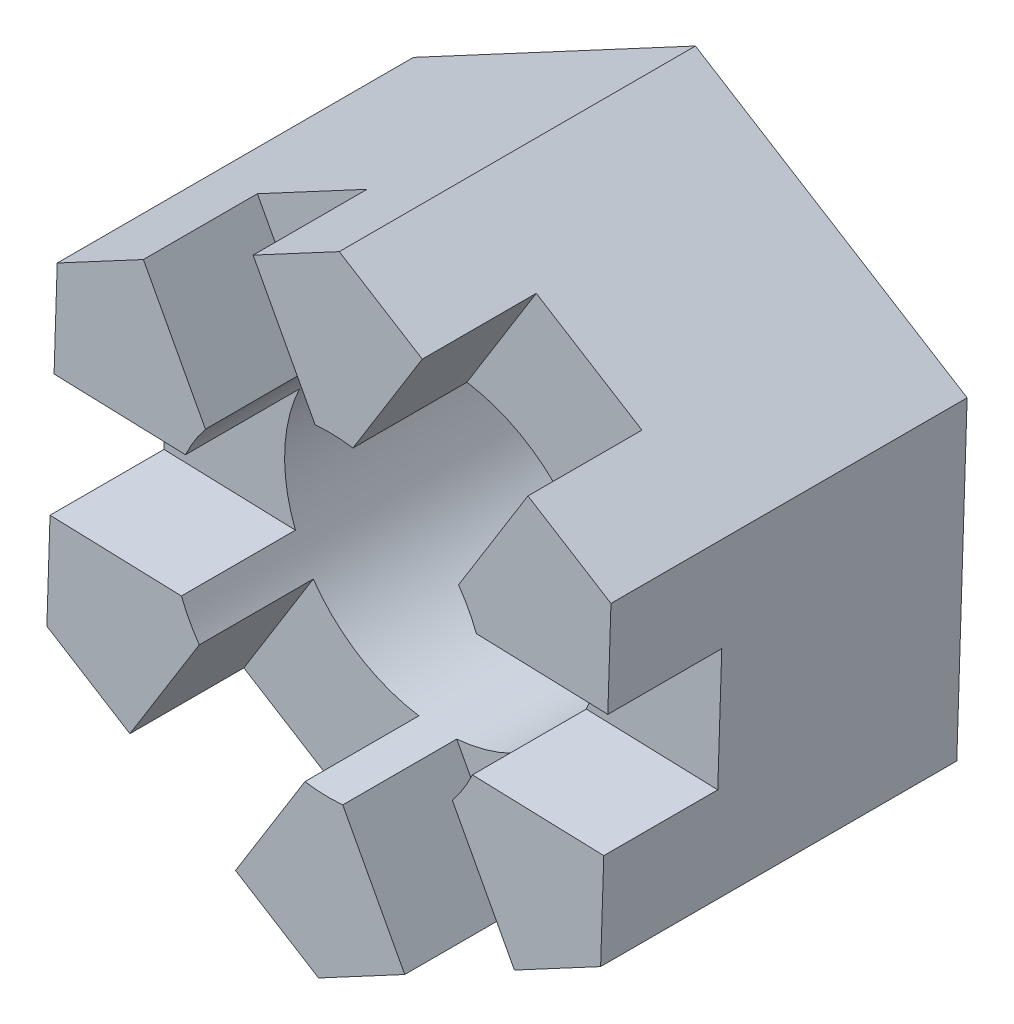
ISO-10303-21;
HEADER;
FILE_DESCRIPTION(('STEP AP214'),'2;1');
FILE_NAME('part.step','',(''),(''),'','','');
FILE_SCHEMA(('AUTOMOTIVE_DESIGN { 1 0 10303 214 1 1 1 1 }'));
ENDSEC;
DATA;
#1=APPLICATION_CONTEXT('core data for automotive mechanical design processes');
#2=APPLICATION_PROTOCOL_DEFINITION('international standard','automotive_design',2000,#1);
#3=PRODUCT_CONTEXT('',#1,'mechanical');
#4=PRODUCT('Part','Part','',(#3));
#5=PRODUCT_RELATED_PRODUCT_CATEGORY('part','',(#4));
#6=PRODUCT_DEFINITION_FORMATION('','',#4);
#7=PRODUCT_DEFINITION_CONTEXT('part definition',#1,'design');
#8=PRODUCT_DEFINITION('design','',#6,#7);
#9=PRODUCT_DEFINITION_SHAPE('','',#8);
#10=(LENGTH_UNIT() NAMED_UNIT(*) SI_UNIT(.MILLI.,.METRE.));
#11=(NAMED_UNIT(*) PLANE_ANGLE_UNIT() SI_UNIT($,.RADIAN.));
#12=(NAMED_UNIT(*) SI_UNIT($,.STERADIAN.) SOLID_ANGLE_UNIT());
#13=UNCERTAINTY_MEASURE_WITH_UNIT(LENGTH_MEASURE(1.E-05),#10,'distance_accuracy_value','');
#14=(GEOMETRIC_REPRESENTATION_CONTEXT(3) GLOBAL_UNCERTAINTY_ASSIGNED_CONTEXT((#13)) GLOBAL_UNIT_ASSIGNED_CONTEXT((#10,
#11,#12)) REPRESENTATION_CONTEXT('',''));
#15=CARTESIAN_POINT('',(0.,0.,0.));
#16=DIRECTION('',(0.,0.,1.));
#17=DIRECTION('',(1.,0.,0.));
#18=AXIS2_PLACEMENT_3D('',#15,#16,#17);
#19=CARTESIAN_POINT('',(5.65719187726186,3.0263397276538,7.14375));
#20=DIRECTION('',(0.,0.,1.));
#21=DIRECTION('',(1.,0.,0.));
#22=AXIS2_PLACEMENT_3D('',#19,#20,#21);
#23=PLANE('',#22);
#24=DIRECTION('',(-0.471700712644366,0.881758718522702,0.));
#25=VECTOR('',#24,1.);
#26=CARTESIAN_POINT('',(-1.89543674075156,6.18754430662847,7.14375));
#27=LINE('',#26,#25);
#28=CARTESIAN_POINT('',(-0.277369211780051,3.16286125531243,7.14375));
#29=VERTEX_POINT('',#28);
#30=CARTESIAN_POINT('',(-1.5210243000901,5.48764832380109,7.14375));
#31=VERTEX_POINT('',#30);
#32=EDGE_CURVE('E260',#29,#31,#27,.T.);
#33=ORIENTED_EDGE('',*,*,#32,.F.);
#34=CARTESIAN_POINT('',(0.,0.,7.14375));
#35=DIRECTION('',(0.,0.,1.));
#36=DIRECTION('',(1.,0.,0.));
#37=AXIS2_PLACEMENT_3D('',#34,#35,#36);
#38=CIRCLE('',#37,3.175);
#39=CARTESIAN_POINT('',(0.48147291031505,3.13828119145381,7.14375));
#40=VERTEX_POINT('',#39);
#41=EDGE_CURVE('E321',#40,#29,#38,.T.);
#42=ORIENTED_EDGE('',*,*,#41,.F.);
#43=DIRECTION('',(-0.527775093926886,-0.849384159394598,0.));
#44=VECTOR('',#43,1.);
#45=CARTESIAN_POINT('',(-4.41085218620622,-4.73526852207148,7.14375));
#46=LINE('',#45,#44);
#47=CARTESIAN_POINT('',(1.87297002586075,5.37771162572043,7.14375));
#48=VERTEX_POINT('',#47);
#49=EDGE_CURVE('E289',#48,#40,#46,.T.);
#50=ORIENTED_EDGE('',*,*,#49,.F.);
#51=DIRECTION('',(-0.849384159394597,0.527775093926886,0.));
#52=VECTOR('',#51,1.);
#53=CARTESIAN_POINT('',(5.65719187726186,3.0263397276538,7.14375));
#54=LINE('',#53,#52);
#55=CARTESIAN_POINT('',(0.207708854000658,6.41244174361865,7.14375));
#56=VERTEX_POINT('',#55);
#57=EDGE_CURVE('E327',#48,#56,#54,.T.);
#58=ORIENTED_EDGE('',*,*,#57,.T.);
#59=DIRECTION('',(-0.8817587185227,-0.471700712644369,0.));
#60=VECTOR('',#59,1.);
#61=CARTESIAN_POINT('',(0.207708854000658,6.41244174361865,7.14375));
#62=LINE('',#61,#60);
#63=EDGE_CURVE('E332',#56,#31,#62,.T.);
#64=ORIENTED_EDGE('',*,*,#63,.T.);
#65=EDGE_LOOP('',(#33,#42,#50,#58,#64));
#66=FACE_BOUND('',#65,.T.);
#67=ADVANCED_FACE('F32',(#66),#23,.T.);
#68=DIRECTION('',(0.471700712644366,-0.881758718522702,0.));
#69=VECTOR('',#68,1.);
#70=CARTESIAN_POINT('',(-4.09516230983187,5.01079141860982,7.14375));
#71=LINE('',#70,#69);
#72=CARTESIAN_POINT('',(-3.72074986917041,4.31089543578243,7.14375));
#73=VERTEX_POINT('',#72);
#74=CARTESIAN_POINT('',(-2.47709478086036,1.98610836729378,7.14375));
#75=VERTEX_POINT('',#74);
#76=EDGE_CURVE('E445',#73,#75,#71,.T.);
#77=ORIENTED_EDGE('',*,*,#76,.F.);
#78=CARTESIAN_POINT('',(-5.44948302326121,3.38610201596485,7.14375));
#79=VERTEX_POINT('',#78);
#80=EDGE_CURVE('E331',#73,#79,#62,.T.);
#81=ORIENTED_EDGE('',*,*,#80,.T.);
#82=DIRECTION('',(-0.0323745591281028,-0.999475806571255,0.));
#83=VECTOR('',#82,1.);
#84=CARTESIAN_POINT('',(-5.44948302326121,3.38610201596485,7.14375));
#85=LINE('',#84,#83);
#86=CARTESIAN_POINT('',(-5.51295500549189,1.4265784782491,7.14375));
#87=VERTEX_POINT('',#86);
#88=EDGE_CURVE('E336',#79,#87,#85,.T.);
#89=ORIENTED_EDGE('',*,*,#88,.T.);
#90=DIRECTION('',(-0.999475806571255,0.0323745591281116,0.));
#91=VECTOR('',#90,1.);
#92=CARTESIAN_POINT('',(6.38705381649711,1.04111888363002,7.14375));
#93=LINE('',#92,#91);
#94=CARTESIAN_POINT('',(-2.87780280163612,1.34122184402704,7.14375));
#95=VERTEX_POINT('',#94);
#96=EDGE_CURVE('E441',#95,#87,#93,.T.);
#97=ORIENTED_EDGE('',*,*,#96,.F.);
#98=EDGE_CURVE('E470',#75,#95,#38,.T.);
#99=ORIENTED_EDGE('',*,*,#98,.F.);
#100=EDGE_LOOP('',(#77,#81,#89,#97,#99));
#101=FACE_BOUND('',#100,.T.);
#102=ADVANCED_FACE('F495',(#101),#23,.T.);
#103=CARTESIAN_POINT('',(3.72074986917041,-4.31089543578243,7.14375));
#104=VERTEX_POINT('',#103);
#105=CARTESIAN_POINT('',(2.47709478086036,-1.98610836729378,7.14375));
#106=VERTEX_POINT('',#105);
#107=EDGE_CURVE('E449',#104,#106,#27,.T.);
#108=ORIENTED_EDGE('',*,*,#107,.F.);
#109=DIRECTION('',(0.8817587185227,0.471700712644369,0.));
#110=VECTOR('',#109,1.);
#111=CARTESIAN_POINT('',(-0.207708854000655,-6.41244174361866,7.14375));
#112=LINE('',#111,#110);
#113=CARTESIAN_POINT('',(5.44948302326121,-3.38610201596485,7.14375));
#114=VERTEX_POINT('',#113);
#115=EDGE_CURVE('E343',#104,#114,#112,.T.);
#116=ORIENTED_EDGE('',*,*,#115,.T.);
#117=DIRECTION('',(0.0323745591281028,0.999475806571255,0.));
#118=VECTOR('',#117,1.);
#119=CARTESIAN_POINT('',(5.44948302326121,-3.38610201596485,7.14375));
#120=LINE('',#119,#118);
#121=CARTESIAN_POINT('',(5.51295500549189,-1.4265784782491,7.14375));
#122=VERTEX_POINT('',#121);
#123=EDGE_CURVE('E324',#114,#122,#120,.T.);
#124=ORIENTED_EDGE('',*,*,#123,.T.);
#125=DIRECTION('',(0.999475806571255,-0.0323745591281116,0.));
#126=VECTOR('',#125,1.);
#127=CARTESIAN_POINT('',(6.3062889269578,-1.45227578455704,7.14375));
#128=LINE('',#127,#126);
#129=CARTESIAN_POINT('',(2.87780280163612,-1.34122184402704,7.14375));
#130=VERTEX_POINT('',#129);
#131=EDGE_CURVE('E436',#130,#122,#128,.T.);
#132=ORIENTED_EDGE('',*,*,#131,.F.);
#133=EDGE_CURVE('E319',#106,#130,#38,.T.);
#134=ORIENTED_EDGE('',*,*,#133,.F.);
#135=EDGE_LOOP('',(#108,#116,#124,#132,#134));
#136=FACE_BOUND('',#135,.T.);
#137=ADVANCED_FACE('F466',(#136),#23,.T.);
#138=CARTESIAN_POINT('',(0.27736921178005,-3.16286125531243,7.14375));
#139=VERTEX_POINT('',#138);
#140=CARTESIAN_POINT('',(1.5210243000901,-5.48764832380109,7.14375));
#141=VERTEX_POINT('',#140);
#142=EDGE_CURVE('E440',#139,#141,#71,.T.);
#143=ORIENTED_EDGE('',*,*,#142,.F.);
#144=CARTESIAN_POINT('',(-0.48147291031505,-3.13828119145381,7.14375));
#145=VERTEX_POINT('',#144);
#146=EDGE_CURVE('E315',#145,#139,#38,.T.);
#147=ORIENTED_EDGE('',*,*,#146,.F.);
#148=DIRECTION('',(0.527775093926886,0.849384159394598,0.));
#149=VECTOR('',#148,1.);
#150=CARTESIAN_POINT('',(-2.29189150666521,-6.05191030223988,7.14375));
#151=LINE('',#150,#149);
#152=CARTESIAN_POINT('',(-1.87297002586075,-5.37771162572043,7.14375));
#153=VERTEX_POINT('',#152);
#154=EDGE_CURVE('E295',#153,#145,#151,.T.);
#155=ORIENTED_EDGE('',*,*,#154,.F.);
#156=DIRECTION('',(0.849384159394597,-0.527775093926886,0.));
#157=VECTOR('',#156,1.);
#158=CARTESIAN_POINT('',(-5.65719187726186,-3.0263397276538,7.14375));
#159=LINE('',#158,#157);
#160=CARTESIAN_POINT('',(-0.207708854000655,-6.41244174361866,7.14375));
#161=VERTEX_POINT('',#160);
#162=EDGE_CURVE('E339',#153,#161,#159,.T.);
#163=ORIENTED_EDGE('',*,*,#162,.T.);
#164=EDGE_CURVE('E344',#161,#141,#112,.T.);
#165=ORIENTED_EDGE('',*,*,#164,.T.);
#166=EDGE_LOOP('',(#143,#147,#155,#163,#165));
#167=FACE_BOUND('',#166,.T.);
#168=ADVANCED_FACE('F525',(#167),#23,.T.);
#169=CARTESIAN_POINT('',(-5.59371989503118,-1.06681618993796,7.14375));
#170=VERTEX_POINT('',#169);
#171=CARTESIAN_POINT('',(-2.95856769117543,-1.15217282416002,7.14375));
#172=VERTEX_POINT('',#171);
#173=EDGE_CURVE('E435',#170,#172,#128,.T.);
#174=ORIENTED_EDGE('',*,*,#173,.F.);
#175=CARTESIAN_POINT('',(-5.65719187726186,-3.0263397276538,7.14375));
#176=VERTEX_POINT('',#175);
#177=EDGE_CURVE('E335',#170,#176,#85,.T.);
#178=ORIENTED_EDGE('',*,*,#177,.T.);
#179=CARTESIAN_POINT('',(-3.99193070540177,-4.06106984555203,7.14375));
#180=VERTEX_POINT('',#179);
#181=EDGE_CURVE('E340',#176,#180,#159,.T.);
#182=ORIENTED_EDGE('',*,*,#181,.T.);
#183=CARTESIAN_POINT('',(-2.60043358985607,-1.82163941128542,7.14375));
#184=VERTEX_POINT('',#183);
#185=EDGE_CURVE('E296',#184,#180,#46,.T.);
#186=ORIENTED_EDGE('',*,*,#185,.F.);
#187=EDGE_CURVE('E318',#172,#184,#38,.T.);
#188=ORIENTED_EDGE('',*,*,#187,.F.);
#189=EDGE_LOOP('',(#174,#178,#182,#186,#188));
#190=FACE_BOUND('',#189,.T.);
#191=ADVANCED_FACE('F503',(#190),#23,.T.);
#192=CARTESIAN_POINT('',(5.59371989503118,1.06681618993796,7.14375));
#193=VERTEX_POINT('',#192);
#194=CARTESIAN_POINT('',(2.95856769117543,1.15217282416002,7.14375));
#195=VERTEX_POINT('',#194);
#196=EDGE_CURVE('E442',#193,#195,#93,.T.);
#197=ORIENTED_EDGE('',*,*,#196,.F.);
#198=CARTESIAN_POINT('',(5.65719187726186,3.0263397276538,7.14375));
#199=VERTEX_POINT('',#198);
#200=EDGE_CURVE('E252',#193,#199,#120,.T.);
#201=ORIENTED_EDGE('',*,*,#200,.T.);
#202=CARTESIAN_POINT('',(3.99193070540177,4.06106984555203,7.14375));
#203=VERTEX_POINT('',#202);
#204=EDGE_CURVE('E328',#199,#203,#54,.T.);
#205=ORIENTED_EDGE('',*,*,#204,.T.);
#206=CARTESIAN_POINT('',(2.60043358985607,1.82163941128542,7.14375));
#207=VERTEX_POINT('',#206);
#208=EDGE_CURVE('E284',#207,#203,#151,.T.);
#209=ORIENTED_EDGE('',*,*,#208,.F.);
#210=EDGE_CURVE('E320',#195,#207,#38,.T.);
#211=ORIENTED_EDGE('',*,*,#210,.F.);
#212=EDGE_LOOP('',(#197,#201,#205,#209,#211));
#213=FACE_BOUND('',#212,.T.);
#214=ADVANCED_FACE('F541',(#213),#23,.T.);
#215=CARTESIAN_POINT('',(5.65719187726186,3.0263397276538,0.));
#216=DIRECTION('',(0.,0.,1.));
#217=DIRECTION('',(1.,0.,0.));
#218=AXIS2_PLACEMENT_3D('',#215,#216,#217);
#219=PLANE('',#218);
#220=DIRECTION('',(0.0323745591281028,0.999475806571255,0.));
#221=VECTOR('',#220,1.);
#222=CARTESIAN_POINT('',(5.44948302326121,-3.38610201596485,0.));
#223=LINE('',#222,#221);
#224=CARTESIAN_POINT('',(5.44948302326121,-3.38610201596485,0.));
#225=VERTEX_POINT('',#224);
#226=CARTESIAN_POINT('',(5.65719187726186,3.0263397276538,0.));
#227=VERTEX_POINT('',#226);
#228=EDGE_CURVE('E348',#225,#227,#223,.T.);
#229=ORIENTED_EDGE('',*,*,#228,.F.);
#230=DIRECTION('',(0.8817587185227,0.471700712644369,0.));
#231=VECTOR('',#230,1.);
#232=CARTESIAN_POINT('',(-0.207708854000655,-6.41244174361866,0.));
#233=LINE('',#232,#231);
#234=CARTESIAN_POINT('',(-0.207708854000655,-6.41244174361866,0.));
#235=VERTEX_POINT('',#234);
#236=EDGE_CURVE('E359',#235,#225,#233,.T.);
#237=ORIENTED_EDGE('',*,*,#236,.F.);
#238=DIRECTION('',(0.849384159394597,-0.527775093926886,0.));
#239=VECTOR('',#238,1.);
#240=CARTESIAN_POINT('',(-5.65719187726186,-3.0263397276538,0.));
#241=LINE('',#240,#239);
#242=CARTESIAN_POINT('',(-5.65719187726186,-3.0263397276538,0.));
#243=VERTEX_POINT('',#242);
#244=EDGE_CURVE('E357',#243,#235,#241,.T.);
#245=ORIENTED_EDGE('',*,*,#244,.F.);
#246=DIRECTION('',(-0.0323745591281028,-0.999475806571255,0.));
#247=VECTOR('',#246,1.);
#248=CARTESIAN_POINT('',(-5.44948302326121,3.38610201596485,0.));
#249=LINE('',#248,#247);
#250=CARTESIAN_POINT('',(-5.44948302326121,3.38610201596485,0.));
#251=VERTEX_POINT('',#250);
#252=EDGE_CURVE('E355',#251,#243,#249,.T.);
#253=ORIENTED_EDGE('',*,*,#252,.F.);
#254=DIRECTION('',(-0.8817587185227,-0.471700712644369,0.));
#255=VECTOR('',#254,1.);
#256=CARTESIAN_POINT('',(0.207708854000658,6.41244174361865,0.));
#257=LINE('',#256,#255);
#258=CARTESIAN_POINT('',(0.207708854000658,6.41244174361865,0.));
#259=VERTEX_POINT('',#258);
#260=EDGE_CURVE('E353',#259,#251,#257,.T.);
#261=ORIENTED_EDGE('',*,*,#260,.F.);
#262=DIRECTION('',(-0.849384159394597,0.527775093926886,0.));
#263=VECTOR('',#262,1.);
#264=CARTESIAN_POINT('',(5.65719187726186,3.0263397276538,0.));
#265=LINE('',#264,#263);
#266=EDGE_CURVE('E351',#227,#259,#265,.T.);
#267=ORIENTED_EDGE('',*,*,#266,.F.);
#268=EDGE_LOOP('',(#229,#237,#245,#253,#261,#267));
#269=FACE_BOUND('',#268,.T.);
#270=CARTESIAN_POINT('',(0.,0.,0.));
#271=DIRECTION('',(0.,0.,1.));
#272=DIRECTION('',(1.,0.,0.));
#273=AXIS2_PLACEMENT_3D('',#270,#271,#272);
#274=CIRCLE('',#273,3.175);
#275=CARTESIAN_POINT('',(3.175,0.,0.));
#276=VERTEX_POINT('',#275);
#277=EDGE_CURVE('E314',#276,#276,#274,.T.);
#278=ORIENTED_EDGE('',*,*,#277,.T.);
#279=EDGE_LOOP('',(#278));
#280=FACE_BOUND('',#279,.T.);
#281=ADVANCED_FACE('F548',(#269,#280),#219,.F.);
#282=CARTESIAN_POINT('',(5.44948302326121,-3.38610201596485,7.14375));
#283=DIRECTION('',(-0.999475806571255,0.0323745591281028,0.));
#284=DIRECTION('',(-0.0323745591281028,-0.999475806571255,0.));
#285=AXIS2_PLACEMENT_3D('',#282,#283,#284);
#286=PLANE('',#285);
#287=DIRECTION('',(0.0323745591281028,0.999475806571255,0.));
#288=VECTOR('',#287,1.);
#289=CARTESIAN_POINT('',(5.44948302326121,-3.38610201596485,4.85775));
#290=LINE('',#289,#288);
#291=CARTESIAN_POINT('',(5.51295500549189,-1.4265784782491,4.85775));
#292=VERTEX_POINT('',#291);
#293=CARTESIAN_POINT('',(5.59371989503118,1.06681618993796,4.85775));
#294=VERTEX_POINT('',#293);
#295=EDGE_CURVE('E229',#292,#294,#290,.T.);
#296=ORIENTED_EDGE('',*,*,#295,.F.);
#297=DIRECTION('',(0.,0.,1.));
#298=VECTOR('',#297,1.);
#299=CARTESIAN_POINT('',(5.51295500549189,-1.4265784782491,7.14375));
#300=LINE('',#299,#298);
#301=EDGE_CURVE('E253',#292,#122,#300,.T.);
#302=ORIENTED_EDGE('',*,*,#301,.T.);
#303=ORIENTED_EDGE('',*,*,#123,.F.);
#304=DIRECTION('',(0.,0.,-1.));
#305=VECTOR('',#304,1.);
#306=CARTESIAN_POINT('',(5.44948302326121,-3.38610201596485,7.14375));
#307=LINE('',#306,#305);
#308=EDGE_CURVE('E347',#114,#225,#307,.T.);
#309=ORIENTED_EDGE('',*,*,#308,.T.);
#310=ORIENTED_EDGE('',*,*,#228,.T.);
#311=DIRECTION('',(0.,0.,-1.));
#312=VECTOR('',#311,1.);
#313=CARTESIAN_POINT('',(5.65719187726186,3.0263397276538,7.14375));
#314=LINE('',#313,#312);
#315=EDGE_CURVE('E375',#199,#227,#314,.T.);
#316=ORIENTED_EDGE('',*,*,#315,.F.);
#317=ORIENTED_EDGE('',*,*,#200,.F.);
#318=DIRECTION('',(0.,0.,-1.));
#319=VECTOR('',#318,1.);
#320=CARTESIAN_POINT('',(5.59371989503118,1.06681618993796,7.14375));
#321=LINE('',#320,#319);
#322=EDGE_CURVE('E244',#193,#294,#321,.T.);
#323=ORIENTED_EDGE('',*,*,#322,.T.);
#324=EDGE_LOOP('',(#296,#302,#303,#309,#310,#316,#317,#323));
#325=FACE_BOUND('',#324,.T.);
#326=ADVANCED_FACE('F34',(#325),#286,.F.);
#327=CARTESIAN_POINT('',(5.65719187726186,3.0263397276538,7.14375));
#328=DIRECTION('',(-0.527775093926886,-0.849384159394597,0.));
#329=DIRECTION('',(0.849384159394597,-0.527775093926886,0.));
#330=AXIS2_PLACEMENT_3D('',#327,#328,#329);
#331=PLANE('',#330);
#332=ORIENTED_EDGE('',*,*,#57,.F.);
#333=DIRECTION('',(0.,0.,-1.));
#334=VECTOR('',#333,1.);
#335=CARTESIAN_POINT('',(1.87297002586075,5.37771162572043,7.14375));
#336=LINE('',#335,#334);
#337=CARTESIAN_POINT('',(1.87297002586075,5.37771162572043,4.85775));
#338=VERTEX_POINT('',#337);
#339=EDGE_CURVE('E311',#48,#338,#336,.T.);
#340=ORIENTED_EDGE('',*,*,#339,.T.);
#341=DIRECTION('',(-0.849384159394597,0.527775093926886,0.));
#342=VECTOR('',#341,1.);
#343=CARTESIAN_POINT('',(5.65719187726186,3.0263397276538,4.85775));
#344=LINE('',#343,#342);
#345=CARTESIAN_POINT('',(3.99193070540177,4.06106984555203,4.85775));
#346=VERTEX_POINT('',#345);
#347=EDGE_CURVE('E300',#346,#338,#344,.T.);
#348=ORIENTED_EDGE('',*,*,#347,.F.);
#349=DIRECTION('',(0.,0.,1.));
#350=VECTOR('',#349,1.);
#351=CARTESIAN_POINT('',(3.99193070540176,4.06106984555203,7.14375));
#352=LINE('',#351,#350);
#353=EDGE_CURVE('E305',#346,#203,#352,.T.);
#354=ORIENTED_EDGE('',*,*,#353,.T.);
#355=ORIENTED_EDGE('',*,*,#204,.F.);
#356=ORIENTED_EDGE('',*,*,#315,.T.);
#357=ORIENTED_EDGE('',*,*,#266,.T.);
#358=DIRECTION('',(0.,0.,-1.));
#359=VECTOR('',#358,1.);
#360=CARTESIAN_POINT('',(0.207708854000658,6.41244174361865,7.14375));
#361=LINE('',#360,#359);
#362=EDGE_CURVE('E372',#56,#259,#361,.T.);
#363=ORIENTED_EDGE('',*,*,#362,.F.);
#364=EDGE_LOOP('',(#332,#340,#348,#354,#355,#356,#357,#363));
#365=FACE_BOUND('',#364,.T.);
#366=ADVANCED_FACE('F564',(#365),#331,.F.);
#367=CARTESIAN_POINT('',(0.207708854000658,6.41244174361865,7.14375));
#368=DIRECTION('',(0.471700712644369,-0.8817587185227,0.));
#369=DIRECTION('',(0.8817587185227,0.471700712644369,0.));
#370=AXIS2_PLACEMENT_3D('',#367,#368,#369);
#371=PLANE('',#370);
#372=DIRECTION('',(-0.8817587185227,-0.471700712644369,0.));
#373=VECTOR('',#372,1.);
#374=CARTESIAN_POINT('',(0.207708854000658,6.41244174361865,4.85775));
#375=LINE('',#374,#373);
#376=CARTESIAN_POINT('',(-1.5210243000901,5.48764832380109,4.85775));
#377=VERTEX_POINT('',#376);
#378=CARTESIAN_POINT('',(-3.72074986917041,4.31089543578243,4.85775));
#379=VERTEX_POINT('',#378);
#380=EDGE_CURVE('E240',#377,#379,#375,.T.);
#381=ORIENTED_EDGE('',*,*,#380,.F.);
#382=DIRECTION('',(0.,0.,1.));
#383=VECTOR('',#382,1.);
#384=CARTESIAN_POINT('',(-1.5210243000901,5.48764832380109,7.14375));
#385=LINE('',#384,#383);
#386=EDGE_CURVE('E275',#377,#31,#385,.T.);
#387=ORIENTED_EDGE('',*,*,#386,.T.);
#388=ORIENTED_EDGE('',*,*,#63,.F.);
#389=ORIENTED_EDGE('',*,*,#362,.T.);
#390=ORIENTED_EDGE('',*,*,#260,.T.);
#391=DIRECTION('',(0.,0.,-1.));
#392=VECTOR('',#391,1.);
#393=CARTESIAN_POINT('',(-5.44948302326121,3.38610201596485,7.14375));
#394=LINE('',#393,#392);
#395=EDGE_CURVE('E369',#79,#251,#394,.T.);
#396=ORIENTED_EDGE('',*,*,#395,.F.);
#397=ORIENTED_EDGE('',*,*,#80,.F.);
#398=DIRECTION('',(0.,0.,-1.));
#399=VECTOR('',#398,1.);
#400=CARTESIAN_POINT('',(-3.72074986917041,4.31089543578243,7.14375));
#401=LINE('',#400,#399);
#402=EDGE_CURVE('E239',#73,#379,#401,.T.);
#403=ORIENTED_EDGE('',*,*,#402,.T.);
#404=EDGE_LOOP('',(#381,#387,#388,#389,#390,#396,#397,#403));
#405=FACE_BOUND('',#404,.T.);
#406=ADVANCED_FACE('F484',(#405),#371,.F.);
#407=CARTESIAN_POINT('',(-5.44948302326121,3.38610201596485,7.14375));
#408=DIRECTION('',(0.999475806571255,-0.0323745591281028,0.));
#409=DIRECTION('',(0.0323745591281028,0.999475806571255,0.));
#410=AXIS2_PLACEMENT_3D('',#407,#408,#409);
#411=PLANE('',#410);
#412=DIRECTION('',(-0.0323745591281028,-0.999475806571255,0.));
#413=VECTOR('',#412,1.);
#414=CARTESIAN_POINT('',(-5.44948302326121,3.38610201596485,4.85775));
#415=LINE('',#414,#413);
#416=CARTESIAN_POINT('',(-5.51295500549189,1.4265784782491,4.85775));
#417=VERTEX_POINT('',#416);
#418=CARTESIAN_POINT('',(-5.59371989503118,-1.06681618993796,4.85775));
#419=VERTEX_POINT('',#418);
#420=EDGE_CURVE('E270',#417,#419,#415,.T.);
#421=ORIENTED_EDGE('',*,*,#420,.F.);
#422=DIRECTION('',(0.,0.,1.));
#423=VECTOR('',#422,1.);
#424=CARTESIAN_POINT('',(-5.51295500549189,1.4265784782491,7.14375));
#425=LINE('',#424,#423);
#426=EDGE_CURVE('E265',#417,#87,#425,.T.);
#427=ORIENTED_EDGE('',*,*,#426,.T.);
#428=ORIENTED_EDGE('',*,*,#88,.F.);
#429=ORIENTED_EDGE('',*,*,#395,.T.);
#430=ORIENTED_EDGE('',*,*,#252,.T.);
#431=DIRECTION('',(0.,0.,-1.));
#432=VECTOR('',#431,1.);
#433=CARTESIAN_POINT('',(-5.65719187726186,-3.0263397276538,7.14375));
#434=LINE('',#433,#432);
#435=EDGE_CURVE('E366',#176,#243,#434,.T.);
#436=ORIENTED_EDGE('',*,*,#435,.F.);
#437=ORIENTED_EDGE('',*,*,#177,.F.);
#438=DIRECTION('',(0.,0.,-1.));
#439=VECTOR('',#438,1.);
#440=CARTESIAN_POINT('',(-5.59371989503118,-1.06681618993796,7.14375));
#441=LINE('',#440,#439);
#442=EDGE_CURVE('E255',#170,#419,#441,.T.);
#443=ORIENTED_EDGE('',*,*,#442,.T.);
#444=EDGE_LOOP('',(#421,#427,#428,#429,#430,#436,#437,#443));
#445=FACE_BOUND('',#444,.T.);
#446=ADVANCED_FACE('F497',(#445),#411,.F.);
#447=CARTESIAN_POINT('',(-5.65719187726186,-3.0263397276538,7.14375));
#448=DIRECTION('',(0.527775093926886,0.849384159394597,0.));
#449=DIRECTION('',(-0.849384159394597,0.527775093926886,0.));
#450=AXIS2_PLACEMENT_3D('',#447,#448,#449);
#451=PLANE('',#450);
#452=DIRECTION('',(0.849384159394597,-0.527775093926886,0.));
#453=VECTOR('',#452,1.);
#454=CARTESIAN_POINT('',(-5.65719187726186,-3.0263397276538,4.85775));
#455=LINE('',#454,#453);
#456=CARTESIAN_POINT('',(-3.99193070540177,-4.06106984555203,4.85775));
#457=VERTEX_POINT('',#456);
#458=CARTESIAN_POINT('',(-1.87297002586075,-5.37771162572043,4.85775));
#459=VERTEX_POINT('',#458);
#460=EDGE_CURVE('E298',#457,#459,#455,.T.);
#461=ORIENTED_EDGE('',*,*,#460,.F.);
#462=DIRECTION('',(0.,0.,1.));
#463=VECTOR('',#462,1.);
#464=CARTESIAN_POINT('',(-3.99193070540177,-4.06106984555203,7.14375));
#465=LINE('',#464,#463);
#466=EDGE_CURVE('E308',#457,#180,#465,.T.);
#467=ORIENTED_EDGE('',*,*,#466,.T.);
#468=ORIENTED_EDGE('',*,*,#181,.F.);
#469=ORIENTED_EDGE('',*,*,#435,.T.);
#470=ORIENTED_EDGE('',*,*,#244,.T.);
#471=DIRECTION('',(0.,0.,-1.));
#472=VECTOR('',#471,1.);
#473=CARTESIAN_POINT('',(-0.207708854000655,-6.41244174361866,7.14375));
#474=LINE('',#473,#472);
#475=EDGE_CURVE('E363',#161,#235,#474,.T.);
#476=ORIENTED_EDGE('',*,*,#475,.F.);
#477=ORIENTED_EDGE('',*,*,#162,.F.);
#478=DIRECTION('',(0.,0.,-1.));
#479=VECTOR('',#478,1.);
#480=CARTESIAN_POINT('',(-1.87297002586075,-5.37771162572043,7.14375));
#481=LINE('',#480,#479);
#482=EDGE_CURVE('E302',#153,#459,#481,.T.);
#483=ORIENTED_EDGE('',*,*,#482,.T.);
#484=EDGE_LOOP('',(#461,#467,#468,#469,#470,#476,#477,#483));
#485=FACE_BOUND('',#484,.T.);
#486=ADVANCED_FACE('F511',(#485),#451,.F.);
#487=CARTESIAN_POINT('',(-0.207708854000655,-6.41244174361866,7.14375));
#488=DIRECTION('',(-0.471700712644369,0.8817587185227,0.));
#489=DIRECTION('',(-0.8817587185227,-0.471700712644369,0.));
#490=AXIS2_PLACEMENT_3D('',#487,#488,#489);
#491=PLANE('',#490);
#492=ORIENTED_EDGE('',*,*,#115,.F.);
#493=DIRECTION('',(0.,0.,-1.));
#494=VECTOR('',#493,1.);
#495=CARTESIAN_POINT('',(3.72074986917041,-4.31089543578243,7.14375));
#496=LINE('',#495,#494);
#497=CARTESIAN_POINT('',(3.72074986917041,-4.31089543578243,4.85775));
#498=VERTEX_POINT('',#497);
#499=EDGE_CURVE('E281',#104,#498,#496,.T.);
#500=ORIENTED_EDGE('',*,*,#499,.T.);
#501=DIRECTION('',(0.8817587185227,0.471700712644369,0.));
#502=VECTOR('',#501,1.);
#503=CARTESIAN_POINT('',(-0.207708854000655,-6.41244174361866,4.85775));
#504=LINE('',#503,#502);
#505=CARTESIAN_POINT('',(1.5210243000901,-5.48764832380109,4.85775));
#506=VERTEX_POINT('',#505);
#507=EDGE_CURVE('E268',#506,#498,#504,.T.);
#508=ORIENTED_EDGE('',*,*,#507,.F.);
#509=DIRECTION('',(0.,0.,1.));
#510=VECTOR('',#509,1.);
#511=CARTESIAN_POINT('',(1.5210243000901,-5.48764832380109,7.14375));
#512=LINE('',#511,#510);
#513=EDGE_CURVE('E278',#506,#141,#512,.T.);
#514=ORIENTED_EDGE('',*,*,#513,.T.);
#515=ORIENTED_EDGE('',*,*,#164,.F.);
#516=ORIENTED_EDGE('',*,*,#475,.T.);
#517=ORIENTED_EDGE('',*,*,#236,.T.);
#518=ORIENTED_EDGE('',*,*,#308,.F.);
#519=EDGE_LOOP('',(#492,#500,#508,#514,#515,#516,#517,#518));
#520=FACE_BOUND('',#519,.T.);
#521=ADVANCED_FACE('F460',(#520),#491,.F.);
#522=CARTESIAN_POINT('',(0.,0.,7.14375));
#523=DIRECTION('',(0.,0.,-1.));
#524=DIRECTION('',(-1.,0.,0.));
#525=AXIS2_PLACEMENT_3D('',#522,#523,#524);
#526=CYLINDRICAL_SURFACE('',#525,3.175);
#527=DIRECTION('',(0.,0.,-1.));
#528=VECTOR('',#527,1.);
#529=CARTESIAN_POINT('',(-0.277369211780051,3.16286125531243,7.14375));
#530=LINE('',#529,#528);
#531=CARTESIAN_POINT('',(-0.277369211780051,3.16286125531243,4.85775));
#532=VERTEX_POINT('',#531);
#533=EDGE_CURVE('E11',#532,#29,#530,.F.);
#534=ORIENTED_EDGE('',*,*,#533,.F.);
#535=CARTESIAN_POINT('',(0.,0.,4.85775));
#536=DIRECTION('',(0.,0.,1.));
#537=DIRECTION('',(1.,0.,0.));
#538=AXIS2_PLACEMENT_3D('',#535,#536,#537);
#539=CIRCLE('',#538,3.175);
#540=CARTESIAN_POINT('',(-2.47709478086036,1.98610836729378,4.85775));
#541=VERTEX_POINT('',#540);
#542=EDGE_CURVE('E398',#532,#541,#539,.T.);
#543=ORIENTED_EDGE('',*,*,#542,.T.);
#544=DIRECTION('',(0.,0.,-1.));
#545=VECTOR('',#544,1.);
#546=CARTESIAN_POINT('',(-2.47709478086036,1.98610836729378,7.14375));
#547=LINE('',#546,#545);
#548=EDGE_CURVE('E40',#75,#541,#547,.T.);
#549=ORIENTED_EDGE('',*,*,#548,.F.);
#550=ORIENTED_EDGE('',*,*,#98,.T.);
#551=DIRECTION('',(0.,0.,-1.));
#552=VECTOR('',#551,1.);
#553=CARTESIAN_POINT('',(-2.87780280163612,1.34122184402704,7.14375));
#554=LINE('',#553,#552);
#555=CARTESIAN_POINT('',(-2.87780280163612,1.34122184402704,4.85775));
#556=VERTEX_POINT('',#555);
#557=EDGE_CURVE('E403',#556,#95,#554,.F.);
#558=ORIENTED_EDGE('',*,*,#557,.F.);
#559=CARTESIAN_POINT('',(-2.95856769117543,-1.15217282416002,4.85775));
#560=VERTEX_POINT('',#559);
#561=EDGE_CURVE('E399',#556,#560,#539,.T.);
#562=ORIENTED_EDGE('',*,*,#561,.T.);
#563=DIRECTION('',(0.,0.,-1.));
#564=VECTOR('',#563,1.);
#565=CARTESIAN_POINT('',(-2.95856769117543,-1.15217282416002,7.14375));
#566=LINE('',#565,#564);
#567=EDGE_CURVE('E401',#172,#560,#566,.T.);
#568=ORIENTED_EDGE('',*,*,#567,.F.);
#569=ORIENTED_EDGE('',*,*,#187,.T.);
#570=DIRECTION('',(0.,0.,-1.));
#571=VECTOR('',#570,1.);
#572=CARTESIAN_POINT('',(-2.60043358985607,-1.82163941128542,7.14375));
#573=LINE('',#572,#571);
#574=CARTESIAN_POINT('',(-2.60043358985607,-1.82163941128542,4.85775));
#575=VERTEX_POINT('',#574);
#576=EDGE_CURVE('E385',#575,#184,#573,.F.);
#577=ORIENTED_EDGE('',*,*,#576,.F.);
#578=CARTESIAN_POINT('',(0.,0.,4.85775));
#579=DIRECTION('',(0.,0.,1.));
#580=DIRECTION('',(1.,0.,0.));
#581=AXIS2_PLACEMENT_3D('',#578,#579,#580);
#582=CIRCLE('',#581,3.175);
#583=CARTESIAN_POINT('',(-0.48147291031505,-3.13828119145381,4.85775));
#584=VERTEX_POINT('',#583);
#585=EDGE_CURVE('E378',#575,#584,#582,.T.);
#586=ORIENTED_EDGE('',*,*,#585,.T.);
#587=DIRECTION('',(0.,0.,-1.));
#588=VECTOR('',#587,1.);
#589=CARTESIAN_POINT('',(-0.48147291031505,-3.13828119145381,7.14375));
#590=LINE('',#589,#588);
#591=EDGE_CURVE('E381',#145,#584,#590,.T.);
#592=ORIENTED_EDGE('',*,*,#591,.F.);
#593=ORIENTED_EDGE('',*,*,#146,.T.);
#594=DIRECTION('',(0.,0.,-1.));
#595=VECTOR('',#594,1.);
#596=CARTESIAN_POINT('',(0.277369211780051,-3.16286125531243,7.14375));
#597=LINE('',#596,#595);
#598=CARTESIAN_POINT('',(0.27736921178005,-3.16286125531243,4.85775));
#599=VERTEX_POINT('',#598);
#600=EDGE_CURVE('E406',#599,#139,#597,.F.);
#601=ORIENTED_EDGE('',*,*,#600,.F.);
#602=CARTESIAN_POINT('',(2.47709478086036,-1.98610836729378,4.85775));
#603=VERTEX_POINT('',#602);
#604=EDGE_CURVE('E405',#599,#603,#539,.T.);
#605=ORIENTED_EDGE('',*,*,#604,.T.);
#606=DIRECTION('',(0.,0.,-1.));
#607=VECTOR('',#606,1.);
#608=CARTESIAN_POINT('',(2.47709478086036,-1.98610836729378,7.14375));
#609=LINE('',#608,#607);
#610=EDGE_CURVE('E408',#106,#603,#609,.T.);
#611=ORIENTED_EDGE('',*,*,#610,.F.);
#612=ORIENTED_EDGE('',*,*,#133,.T.);
#613=DIRECTION('',(0.,0.,-1.));
#614=VECTOR('',#613,1.);
#615=CARTESIAN_POINT('',(2.87780280163612,-1.34122184402704,7.14375));
#616=LINE('',#615,#614);
#617=CARTESIAN_POINT('',(2.87780280163612,-1.34122184402704,4.85775));
#618=VERTEX_POINT('',#617);
#619=EDGE_CURVE('E397',#618,#130,#616,.F.);
#620=ORIENTED_EDGE('',*,*,#619,.F.);
#621=CARTESIAN_POINT('',(2.95856769117543,1.15217282416002,4.85775));
#622=VERTEX_POINT('',#621);
#623=EDGE_CURVE('E395',#618,#622,#539,.T.);
#624=ORIENTED_EDGE('',*,*,#623,.T.);
#625=DIRECTION('',(0.,0.,-1.));
#626=VECTOR('',#625,1.);
#627=CARTESIAN_POINT('',(2.95856769117543,1.15217282416002,7.14375));
#628=LINE('',#627,#626);
#629=EDGE_CURVE('E247',#195,#622,#628,.T.);
#630=ORIENTED_EDGE('',*,*,#629,.F.);
#631=ORIENTED_EDGE('',*,*,#210,.T.);
#632=DIRECTION('',(0.,0.,-1.));
#633=VECTOR('',#632,1.);
#634=CARTESIAN_POINT('',(2.60043358985607,1.82163941128542,7.14375));
#635=LINE('',#634,#633);
#636=CARTESIAN_POINT('',(2.60043358985607,1.82163941128542,4.85775));
#637=VERTEX_POINT('',#636);
#638=EDGE_CURVE('E388',#637,#207,#635,.F.);
#639=ORIENTED_EDGE('',*,*,#638,.F.);
#640=CARTESIAN_POINT('',(0.48147291031505,3.13828119145381,4.85775));
#641=VERTEX_POINT('',#640);
#642=EDGE_CURVE('E382',#637,#641,#582,.T.);
#643=ORIENTED_EDGE('',*,*,#642,.T.);
#644=DIRECTION('',(0.,0.,-1.));
#645=VECTOR('',#644,1.);
#646=CARTESIAN_POINT('',(0.481472910315049,3.13828119145381,7.14375));
#647=LINE('',#646,#645);
#648=EDGE_CURVE('E391',#40,#641,#647,.T.);
#649=ORIENTED_EDGE('',*,*,#648,.F.);
#650=ORIENTED_EDGE('',*,*,#41,.T.);
#651=EDGE_LOOP('',(#534,#543,#549,#550,#558,#562,#568,#569,#577,#586,#592,#593,#601,#605,#611,
#612,#620,#624,#630,#631,#639,#643,#649,#650));
#652=FACE_BOUND('',#651,.T.);
#653=ORIENTED_EDGE('',*,*,#277,.F.);
#654=EDGE_LOOP('',(#653));
#655=FACE_BOUND('',#654,.T.);
#656=ADVANCED_FACE('F420',(#652,#655),#526,.F.);
#657=CARTESIAN_POINT('',(-2.29189150666521,-6.05191030223988,4.85775));
#658=DIRECTION('',(0.,0.,1.));
#659=DIRECTION('',(1.,0.,0.));
#660=AXIS2_PLACEMENT_3D('',#657,#658,#659);
#661=PLANE('',#660);
#662=ORIENTED_EDGE('',*,*,#460,.T.);
#663=DIRECTION('',(0.527775093926886,0.849384159394598,0.));
#664=VECTOR('',#663,1.);
#665=CARTESIAN_POINT('',(-2.29189150666521,-6.05191030223988,4.85775));
#666=LINE('',#665,#664);
#667=EDGE_CURVE('E288',#459,#584,#666,.T.);
#668=ORIENTED_EDGE('',*,*,#667,.T.);
#669=ORIENTED_EDGE('',*,*,#585,.F.);
#670=DIRECTION('',(-0.527775093926886,-0.849384159394598,0.));
#671=VECTOR('',#670,1.);
#672=CARTESIAN_POINT('',(-4.41085218620622,-4.73526852207148,4.85775));
#673=LINE('',#672,#671);
#674=EDGE_CURVE('E290',#575,#457,#673,.T.);
#675=ORIENTED_EDGE('',*,*,#674,.T.);
#676=EDGE_LOOP('',(#662,#668,#669,#675));
#677=FACE_BOUND('',#676,.T.);
#678=ADVANCED_FACE('F518',(#677),#661,.T.);
#679=CARTESIAN_POINT('',(-2.29189150666521,-6.05191030223988,4.85775));
#680=DIRECTION('',(0.849384159394598,-0.527775093926885,0.));
#681=DIRECTION('',(0.527775093926885,0.849384159394598,0.));
#682=AXIS2_PLACEMENT_3D('',#679,#680,#681);
#683=PLANE('',#682);
#684=ORIENTED_EDGE('',*,*,#154,.T.);
#685=ORIENTED_EDGE('',*,*,#591,.T.);
#686=ORIENTED_EDGE('',*,*,#667,.F.);
#687=ORIENTED_EDGE('',*,*,#482,.F.);
#688=EDGE_LOOP('',(#684,#685,#686,#687));
#689=FACE_BOUND('',#688,.T.);
#690=ADVANCED_FACE('F521',(#689),#683,.F.);
#691=CARTESIAN_POINT('',(-4.41085218620622,-4.73526852207148,4.85775));
#692=DIRECTION('',(-0.849384159394598,0.527775093926885,0.));
#693=DIRECTION('',(-0.527775093926885,-0.849384159394598,0.));
#694=AXIS2_PLACEMENT_3D('',#691,#692,#693);
#695=PLANE('',#694);
#696=ORIENTED_EDGE('',*,*,#674,.F.);
#697=ORIENTED_EDGE('',*,*,#576,.T.);
#698=ORIENTED_EDGE('',*,*,#185,.T.);
#699=ORIENTED_EDGE('',*,*,#466,.F.);
#700=EDGE_LOOP('',(#696,#697,#698,#699));
#701=FACE_BOUND('',#700,.T.);
#702=ADVANCED_FACE('F514',(#701),#695,.F.);
#703=ORIENTED_EDGE('',*,*,#49,.T.);
#704=ORIENTED_EDGE('',*,*,#648,.T.);
#705=EDGE_CURVE('E293',#338,#641,#673,.T.);
#706=ORIENTED_EDGE('',*,*,#705,.F.);
#707=ORIENTED_EDGE('',*,*,#339,.F.);
#708=EDGE_LOOP('',(#703,#704,#706,#707));
#709=FACE_BOUND('',#708,.T.);
#710=ADVANCED_FACE('F574',(#709),#695,.F.);
#711=EDGE_CURVE('E285',#637,#346,#666,.T.);
#712=ORIENTED_EDGE('',*,*,#711,.F.);
#713=ORIENTED_EDGE('',*,*,#638,.T.);
#714=ORIENTED_EDGE('',*,*,#208,.T.);
#715=ORIENTED_EDGE('',*,*,#353,.F.);
#716=EDGE_LOOP('',(#712,#713,#714,#715));
#717=FACE_BOUND('',#716,.T.);
#718=ADVANCED_FACE('F568',(#717),#683,.F.);
#719=ORIENTED_EDGE('',*,*,#347,.T.);
#720=ORIENTED_EDGE('',*,*,#705,.T.);
#721=ORIENTED_EDGE('',*,*,#642,.F.);
#722=ORIENTED_EDGE('',*,*,#711,.T.);
#723=EDGE_LOOP('',(#719,#720,#721,#722));
#724=FACE_BOUND('',#723,.T.);
#725=ADVANCED_FACE('F571',(#724),#661,.T.);
#726=CARTESIAN_POINT('',(6.38705381649711,1.04111888363002,4.85775));
#727=DIRECTION('',(0.0323745591281116,0.999475806571255,0.));
#728=DIRECTION('',(-0.999475806571255,0.0323745591281116,0.));
#729=AXIS2_PLACEMENT_3D('',#726,#727,#728);
#730=PLANE('',#729);
#731=ORIENTED_EDGE('',*,*,#196,.T.);
#732=ORIENTED_EDGE('',*,*,#629,.T.);
#733=DIRECTION('',(-0.999475806571255,0.0323745591281116,0.));
#734=VECTOR('',#733,1.);
#735=CARTESIAN_POINT('',(6.38705381649711,1.04111888363002,4.85775));
#736=LINE('',#735,#734);
#737=EDGE_CURVE('E232',#294,#622,#736,.T.);
#738=ORIENTED_EDGE('',*,*,#737,.F.);
#739=ORIENTED_EDGE('',*,*,#322,.F.);
#740=EDGE_LOOP('',(#731,#732,#738,#739));
#741=FACE_BOUND('',#740,.T.);
#742=ADVANCED_FACE('F243',(#741),#730,.F.);
#743=CARTESIAN_POINT('',(6.3062889269578,-1.45227578455704,4.85775));
#744=DIRECTION('',(-0.0323745591281116,-0.999475806571255,0.));
#745=DIRECTION('',(0.999475806571255,-0.0323745591281116,0.));
#746=AXIS2_PLACEMENT_3D('',#743,#744,#745);
#747=PLANE('',#746);
#748=DIRECTION('',(0.999475806571255,-0.0323745591281116,0.));
#749=VECTOR('',#748,1.);
#750=CARTESIAN_POINT('',(6.3062889269578,-1.45227578455704,4.85775));
#751=LINE('',#750,#749);
#752=EDGE_CURVE('E235',#618,#292,#751,.T.);
#753=ORIENTED_EDGE('',*,*,#752,.F.);
#754=ORIENTED_EDGE('',*,*,#619,.T.);
#755=ORIENTED_EDGE('',*,*,#131,.T.);
#756=ORIENTED_EDGE('',*,*,#301,.F.);
#757=EDGE_LOOP('',(#753,#754,#755,#756));
#758=FACE_BOUND('',#757,.T.);
#759=ADVANCED_FACE('F559',(#758),#747,.F.);
#760=CARTESIAN_POINT('',(-4.09516230983187,5.01079141860982,4.85775));
#761=DIRECTION('',(0.,0.,1.));
#762=DIRECTION('',(-0.500000000000004,-0.866025403784436,0.));
#763=AXIS2_PLACEMENT_3D('',#760,#761,#762);
#764=PLANE('',#763);
#765=ORIENTED_EDGE('',*,*,#295,.T.);
#766=ORIENTED_EDGE('',*,*,#737,.T.);
#767=ORIENTED_EDGE('',*,*,#623,.F.);
#768=ORIENTED_EDGE('',*,*,#752,.T.);
#769=EDGE_LOOP('',(#765,#766,#767,#768));
#770=FACE_BOUND('',#769,.T.);
#771=ADVANCED_FACE('F231',(#770),#764,.T.);
#772=ORIENTED_EDGE('',*,*,#173,.T.);
#773=ORIENTED_EDGE('',*,*,#567,.T.);
#774=EDGE_CURVE('E431',#419,#560,#751,.T.);
#775=ORIENTED_EDGE('',*,*,#774,.F.);
#776=ORIENTED_EDGE('',*,*,#442,.F.);
#777=EDGE_LOOP('',(#772,#773,#775,#776));
#778=FACE_BOUND('',#777,.T.);
#779=ADVANCED_FACE('F500',(#778),#747,.F.);
#780=EDGE_CURVE('E248',#556,#417,#736,.T.);
#781=ORIENTED_EDGE('',*,*,#780,.F.);
#782=ORIENTED_EDGE('',*,*,#557,.T.);
#783=ORIENTED_EDGE('',*,*,#96,.T.);
#784=ORIENTED_EDGE('',*,*,#426,.F.);
#785=EDGE_LOOP('',(#781,#782,#783,#784));
#786=FACE_BOUND('',#785,.T.);
#787=ADVANCED_FACE('F433',(#786),#730,.F.);
#788=ORIENTED_EDGE('',*,*,#420,.T.);
#789=ORIENTED_EDGE('',*,*,#774,.T.);
#790=ORIENTED_EDGE('',*,*,#561,.F.);
#791=ORIENTED_EDGE('',*,*,#780,.T.);
#792=EDGE_LOOP('',(#788,#789,#790,#791));
#793=FACE_BOUND('',#792,.T.);
#794=ADVANCED_FACE('F428',(#793),#764,.T.);
#795=ORIENTED_EDGE('',*,*,#507,.T.);
#796=DIRECTION('',(-0.471700712644366,0.881758718522702,0.));
#797=VECTOR('',#796,1.);
#798=CARTESIAN_POINT('',(-1.89543674075156,6.18754430662847,4.85775));
#799=LINE('',#798,#797);
#800=EDGE_CURVE('E55',#498,#603,#799,.T.);
#801=ORIENTED_EDGE('',*,*,#800,.T.);
#802=ORIENTED_EDGE('',*,*,#604,.F.);
#803=DIRECTION('',(0.471700712644366,-0.881758718522702,0.));
#804=VECTOR('',#803,1.);
#805=CARTESIAN_POINT('',(-4.09516230983187,5.01079141860982,4.85775));
#806=LINE('',#805,#804);
#807=EDGE_CURVE('E444',#599,#506,#806,.T.);
#808=ORIENTED_EDGE('',*,*,#807,.T.);
#809=EDGE_LOOP('',(#795,#801,#802,#808));
#810=FACE_BOUND('',#809,.T.);
#811=ADVANCED_FACE('F457',(#810),#764,.T.);
#812=CARTESIAN_POINT('',(-4.09516230983187,5.01079141860982,4.85775));
#813=DIRECTION('',(-0.881758718522702,-0.471700712644365,0.));
#814=DIRECTION('',(0.471700712644365,-0.881758718522702,0.));
#815=AXIS2_PLACEMENT_3D('',#812,#813,#814);
#816=PLANE('',#815);
#817=ORIENTED_EDGE('',*,*,#807,.F.);
#818=ORIENTED_EDGE('',*,*,#600,.T.);
#819=ORIENTED_EDGE('',*,*,#142,.T.);
#820=ORIENTED_EDGE('',*,*,#513,.F.);
#821=EDGE_LOOP('',(#817,#818,#819,#820));
#822=FACE_BOUND('',#821,.T.);
#823=ADVANCED_FACE('F528',(#822),#816,.F.);
#824=CARTESIAN_POINT('',(-1.89543674075156,6.18754430662847,4.85775));
#825=DIRECTION('',(0.881758718522702,0.471700712644365,0.));
#826=DIRECTION('',(-0.471700712644365,0.881758718522702,0.));
#827=AXIS2_PLACEMENT_3D('',#824,#825,#826);
#828=PLANE('',#827);
#829=ORIENTED_EDGE('',*,*,#107,.T.);
#830=ORIENTED_EDGE('',*,*,#610,.T.);
#831=ORIENTED_EDGE('',*,*,#800,.F.);
#832=ORIENTED_EDGE('',*,*,#499,.F.);
#833=EDGE_LOOP('',(#829,#830,#831,#832));
#834=FACE_BOUND('',#833,.T.);
#835=ADVANCED_FACE('F463',(#834),#828,.F.);
#836=EDGE_CURVE('E257',#532,#377,#799,.T.);
#837=ORIENTED_EDGE('',*,*,#836,.F.);
#838=ORIENTED_EDGE('',*,*,#533,.T.);
#839=ORIENTED_EDGE('',*,*,#32,.T.);
#840=ORIENTED_EDGE('',*,*,#386,.F.);
#841=EDGE_LOOP('',(#837,#838,#839,#840));
#842=FACE_BOUND('',#841,.T.);
#843=ADVANCED_FACE('F488',(#842),#828,.F.);
#844=ORIENTED_EDGE('',*,*,#76,.T.);
#845=ORIENTED_EDGE('',*,*,#548,.T.);
#846=EDGE_CURVE('E47',#379,#541,#806,.T.);
#847=ORIENTED_EDGE('',*,*,#846,.F.);
#848=ORIENTED_EDGE('',*,*,#402,.F.);
#849=EDGE_LOOP('',(#844,#845,#847,#848));
#850=FACE_BOUND('',#849,.T.);
#851=ADVANCED_FACE('F490',(#850),#816,.F.);
#852=ORIENTED_EDGE('',*,*,#380,.T.);
#853=ORIENTED_EDGE('',*,*,#846,.T.);
#854=ORIENTED_EDGE('',*,*,#542,.F.);
#855=ORIENTED_EDGE('',*,*,#836,.T.);
#856=EDGE_LOOP('',(#852,#853,#854,#855));
#857=FACE_BOUND('',#856,.T.);
#858=ADVANCED_FACE('F489',(#857),#764,.T.);
#859=CLOSED_SHELL('',(#67,#102,#137,#168,#191,#214,#281,#326,#366,#406,#446,#486,#521,#656,#678,
#690,#702,#710,#718,#725,#742,#759,#771,#779,#787,#794,#811,#823,#835,#843,#851,#858));
#860=MANIFOLD_SOLID_BREP('B2',#859);
#861=ADVANCED_BREP_SHAPE_REPRESENTATION('',(#18,#860),#14);
#862=SHAPE_DEFINITION_REPRESENTATION(#9,#861);
ENDSEC;
END-ISO-10303-21;
